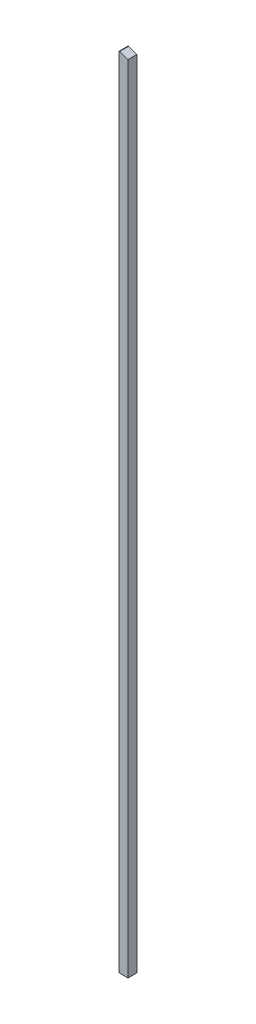
ISO-10303-21;
HEADER;
FILE_DESCRIPTION(('STEP AP214'),'2;1');
FILE_NAME('part.step','',(''),(''),'','','');
FILE_SCHEMA(('AUTOMOTIVE_DESIGN { 1 0 10303 214 1 1 1 1 }'));
ENDSEC;
DATA;
#1=APPLICATION_CONTEXT('core data for automotive mechanical design processes');
#2=APPLICATION_PROTOCOL_DEFINITION('international standard','automotive_design',2000,#1);
#3=PRODUCT_CONTEXT('',#1,'mechanical');
#4=PRODUCT('Part','Part','',(#3));
#5=PRODUCT_RELATED_PRODUCT_CATEGORY('part','',(#4));
#6=PRODUCT_DEFINITION_FORMATION('','',#4);
#7=PRODUCT_DEFINITION_CONTEXT('part definition',#1,'design');
#8=PRODUCT_DEFINITION('design','',#6,#7);
#9=PRODUCT_DEFINITION_SHAPE('','',#8);
#10=(LENGTH_UNIT() NAMED_UNIT(*) SI_UNIT(.MILLI.,.METRE.));
#11=(NAMED_UNIT(*) PLANE_ANGLE_UNIT() SI_UNIT($,.RADIAN.));
#12=(NAMED_UNIT(*) SI_UNIT($,.STERADIAN.) SOLID_ANGLE_UNIT());
#13=UNCERTAINTY_MEASURE_WITH_UNIT(LENGTH_MEASURE(1.E-05),#10,'distance_accuracy_value','');
#14=(GEOMETRIC_REPRESENTATION_CONTEXT(3) GLOBAL_UNCERTAINTY_ASSIGNED_CONTEXT((#13)) GLOBAL_UNIT_ASSIGNED_CONTEXT((#10,
#11,#12)) REPRESENTATION_CONTEXT('',''));
#15=CARTESIAN_POINT('',(0.,0.,0.));
#16=DIRECTION('',(0.,0.,1.));
#17=DIRECTION('',(1.,0.,0.));
#18=AXIS2_PLACEMENT_3D('',#15,#16,#17);
#19=CARTESIAN_POINT('',(-4.44089209850063E-13,2286.00000000001,0.));
#20=DIRECTION('',(1.,0.,0.));
#21=DIRECTION('',(0.,0.,-0.999999999999998));
#22=AXIS2_PLACEMENT_3D('',#19,#20,#21);
#23=PLANE('',#22);
#24=DIRECTION('',(0.,0.,0.999999999999998));
#25=VECTOR('',#24,1.);
#26=CARTESIAN_POINT('',(0.,0.,0.));
#27=LINE('',#26,#25);
#28=CARTESIAN_POINT('',(0.,0.,-25.4000000000001));
#29=VERTEX_POINT('',#28);
#30=CARTESIAN_POINT('',(0.,0.,0.));
#31=VERTEX_POINT('',#30);
#32=EDGE_CURVE('E107',#29,#31,#27,.T.);
#33=ORIENTED_EDGE('',*,*,#32,.T.);
#34=DIRECTION('',(0.,-1.,0.));
#35=VECTOR('',#34,1.);
#36=CARTESIAN_POINT('',(-4.44089209850063E-13,2286.00000000001,0.));
#37=LINE('',#36,#35);
#38=CARTESIAN_POINT('',(-4.44089209850063E-13,2286.00000000001,0.));
#39=VERTEX_POINT('',#38);
#40=EDGE_CURVE('E90',#39,#31,#37,.T.);
#41=ORIENTED_EDGE('',*,*,#40,.F.);
#42=DIRECTION('',(0.,0.,0.999999999999998));
#43=VECTOR('',#42,1.);
#44=CARTESIAN_POINT('',(-4.44089209850063E-13,2286.00000000001,0.));
#45=LINE('',#44,#43);
#46=CARTESIAN_POINT('',(-4.44089209850063E-13,2286.00000000001,-25.4000000000001));
#47=VERTEX_POINT('',#46);
#48=EDGE_CURVE('E97',#47,#39,#45,.T.);
#49=ORIENTED_EDGE('',*,*,#48,.F.);
#50=DIRECTION('',(0.,-1.,0.));
#51=VECTOR('',#50,1.);
#52=CARTESIAN_POINT('',(-4.44089209850063E-13,2286.00000000001,-25.4000000000001));
#53=LINE('',#52,#51);
#54=EDGE_CURVE('E117',#47,#29,#53,.T.);
#55=ORIENTED_EDGE('',*,*,#54,.T.);
#56=EDGE_LOOP('',(#33,#41,#49,#55));
#57=FACE_BOUND('',#56,.T.);
#58=ADVANCED_FACE('F40',(#57),#23,.F.);
#59=CARTESIAN_POINT('',(-4.44089209850063E-13,2286.00000000001,0.));
#60=DIRECTION('',(0.,0.,-0.999999999999998));
#61=DIRECTION('',(-1.,0.,0.));
#62=AXIS2_PLACEMENT_3D('',#59,#60,#61);
#63=PLANE('',#62);
#64=DIRECTION('',(0.,-1.,0.));
#65=VECTOR('',#64,1.);
#66=CARTESIAN_POINT('',(25.4000000000012,2286.,0.));
#67=LINE('',#66,#65);
#68=CARTESIAN_POINT('',(25.400000000001,2277.61800000001,0.));
#69=VERTEX_POINT('',#68);
#70=CARTESIAN_POINT('',(25.4000000000014,2.88657986402541E-12,0.));
#71=VERTEX_POINT('',#70);
#72=EDGE_CURVE('E109',#69,#71,#67,.T.);
#73=ORIENTED_EDGE('',*,*,#72,.F.);
#74=DIRECTION('',(0.943544952869572,-0.331244504730811,0.));
#75=VECTOR('',#74,1.);
#76=CARTESIAN_POINT('',(1.52400000000164,2286.00000000001,0.));
#77=LINE('',#76,#75);
#78=CARTESIAN_POINT('',(1.52400000000164,2286.00000000001,0.));
#79=VERTEX_POINT('',#78);
#80=EDGE_CURVE('E11',#69,#79,#77,.F.);
#81=ORIENTED_EDGE('',*,*,#80,.T.);
#82=DIRECTION('',(1.,0.,0.));
#83=VECTOR('',#82,1.);
#84=CARTESIAN_POINT('',(-4.44089209850063E-13,2286.00000000001,0.));
#85=LINE('',#84,#83);
#86=EDGE_CURVE('E85',#39,#79,#85,.T.);
#87=ORIENTED_EDGE('',*,*,#86,.F.);
#88=ORIENTED_EDGE('',*,*,#40,.T.);
#89=DIRECTION('',(1.,0.,0.));
#90=VECTOR('',#89,1.);
#91=CARTESIAN_POINT('',(0.,0.,0.));
#92=LINE('',#91,#90);
#93=EDGE_CURVE('E123',#31,#71,#92,.T.);
#94=ORIENTED_EDGE('',*,*,#93,.T.);
#95=EDGE_LOOP('',(#73,#81,#87,#88,#94));
#96=FACE_BOUND('',#95,.T.);
#97=ADVANCED_FACE('F87',(#96),#63,.F.);
#98=CARTESIAN_POINT('',(25.4000000000012,2286.,0.));
#99=DIRECTION('',(-1.,0.,0.));
#100=DIRECTION('',(0.,0.,0.999999999999998));
#101=AXIS2_PLACEMENT_3D('',#98,#99,#100);
#102=PLANE('',#101);
#103=DIRECTION('',(0.,-1.,0.));
#104=VECTOR('',#103,1.);
#105=CARTESIAN_POINT('',(25.4000000000012,2286.,-25.4000000000001));
#106=LINE('',#105,#104);
#107=CARTESIAN_POINT('',(25.400000000001,2277.61800000001,-25.4000000000001));
#108=VERTEX_POINT('',#107);
#109=CARTESIAN_POINT('',(25.4000000000014,2.88657986402541E-12,-25.4000000000001));
#110=VERTEX_POINT('',#109);
#111=EDGE_CURVE('E112',#108,#110,#106,.T.);
#112=ORIENTED_EDGE('',*,*,#111,.F.);
#113=DIRECTION('',(0.,0.,0.999999999999998));
#114=VECTOR('',#113,1.);
#115=CARTESIAN_POINT('',(25.400000000001,2277.61800000001,0.));
#116=LINE('',#115,#114);
#117=EDGE_CURVE('E48',#108,#69,#116,.T.);
#118=ORIENTED_EDGE('',*,*,#117,.T.);
#119=ORIENTED_EDGE('',*,*,#72,.T.);
#120=DIRECTION('',(0.,0.,-0.999999999999998));
#121=VECTOR('',#120,1.);
#122=CARTESIAN_POINT('',(25.4000000000014,2.88657986402541E-12,0.));
#123=LINE('',#122,#121);
#124=EDGE_CURVE('E120',#71,#110,#123,.T.);
#125=ORIENTED_EDGE('',*,*,#124,.T.);
#126=EDGE_LOOP('',(#112,#118,#119,#125));
#127=FACE_BOUND('',#126,.T.);
#128=ADVANCED_FACE('F130',(#127),#102,.F.);
#129=CARTESIAN_POINT('',(-4.44089209850063E-13,2286.00000000001,-25.4000000000001));
#130=DIRECTION('',(0.,0.,0.999999999999998));
#131=DIRECTION('',(1.,0.,0.));
#132=AXIS2_PLACEMENT_3D('',#129,#130,#131);
#133=PLANE('',#132);
#134=DIRECTION('',(-1.,0.,0.));
#135=VECTOR('',#134,1.);
#136=CARTESIAN_POINT('',(-4.44089209850063E-13,2286.00000000001,-25.4000000000001));
#137=LINE('',#136,#135);
#138=CARTESIAN_POINT('',(1.52400000000164,2286.00000000001,-25.4000000000001));
#139=VERTEX_POINT('',#138);
#140=EDGE_CURVE('E96',#139,#47,#137,.T.);
#141=ORIENTED_EDGE('',*,*,#140,.F.);
#142=DIRECTION('',(-0.943544952869572,0.331244504730811,0.));
#143=VECTOR('',#142,1.);
#144=CARTESIAN_POINT('',(1.52400000000164,2286.00000000001,-25.4000000000001));
#145=LINE('',#144,#143);
#146=EDGE_CURVE('E62',#139,#108,#145,.F.);
#147=ORIENTED_EDGE('',*,*,#146,.T.);
#148=ORIENTED_EDGE('',*,*,#111,.T.);
#149=DIRECTION('',(-1.,0.,0.));
#150=VECTOR('',#149,1.);
#151=CARTESIAN_POINT('',(0.,0.,-25.4000000000001));
#152=LINE('',#151,#150);
#153=EDGE_CURVE('E104',#110,#29,#152,.T.);
#154=ORIENTED_EDGE('',*,*,#153,.T.);
#155=ORIENTED_EDGE('',*,*,#54,.F.);
#156=EDGE_LOOP('',(#141,#147,#148,#154,#155));
#157=FACE_BOUND('',#156,.T.);
#158=ADVANCED_FACE('F132',(#157),#133,.F.);
#159=CARTESIAN_POINT('',(-4.44089209850063E-13,2286.00000000001,0.));
#160=DIRECTION('',(0.,-1.,0.));
#161=DIRECTION('',(0.,0.,-0.999999999999998));
#162=AXIS2_PLACEMENT_3D('',#159,#160,#161);
#163=PLANE('',#162);
#164=ORIENTED_EDGE('',*,*,#86,.T.);
#165=DIRECTION('',(0.,0.,-0.999999999999998));
#166=VECTOR('',#165,1.);
#167=CARTESIAN_POINT('',(1.52400000000164,2286.00000000001,0.));
#168=LINE('',#167,#166);
#169=EDGE_CURVE('E108',#79,#139,#168,.T.);
#170=ORIENTED_EDGE('',*,*,#169,.T.);
#171=ORIENTED_EDGE('',*,*,#140,.T.);
#172=ORIENTED_EDGE('',*,*,#48,.T.);
#173=EDGE_LOOP('',(#164,#170,#171,#172));
#174=FACE_BOUND('',#173,.T.);
#175=ADVANCED_FACE('F100',(#174),#163,.F.);
#176=CARTESIAN_POINT('',(0.,0.,0.));
#177=DIRECTION('',(0.,-1.,0.));
#178=DIRECTION('',(0.,0.,-0.999999999999998));
#179=AXIS2_PLACEMENT_3D('',#176,#177,#178);
#180=PLANE('',#179);
#181=ORIENTED_EDGE('',*,*,#32,.F.);
#182=ORIENTED_EDGE('',*,*,#153,.F.);
#183=ORIENTED_EDGE('',*,*,#124,.F.);
#184=ORIENTED_EDGE('',*,*,#93,.F.);
#185=EDGE_LOOP('',(#181,#182,#183,#184));
#186=FACE_BOUND('',#185,.T.);
#187=ADVANCED_FACE('F129',(#186),#180,.T.);
#188=CARTESIAN_POINT('',(1.52400000000164,2286.00000000001,0.));
#189=DIRECTION('',(-0.331244504730812,-0.943544952869572,0.));
#190=DIRECTION('',(0.,0.,-0.999999999999998));
#191=AXIS2_PLACEMENT_3D('',#188,#189,#190);
#192=PLANE('',#191);
#193=ORIENTED_EDGE('',*,*,#80,.F.);
#194=ORIENTED_EDGE('',*,*,#117,.F.);
#195=ORIENTED_EDGE('',*,*,#146,.F.);
#196=ORIENTED_EDGE('',*,*,#169,.F.);
#197=EDGE_LOOP('',(#193,#194,#195,#196));
#198=FACE_BOUND('',#197,.T.);
#199=ADVANCED_FACE('F42',(#198),#192,.F.);
#200=CLOSED_SHELL('',(#58,#97,#128,#158,#175,#187,#199));
#201=MANIFOLD_SOLID_BREP('B2',#200);
#202=ADVANCED_BREP_SHAPE_REPRESENTATION('',(#18,#201),#14);
#203=SHAPE_DEFINITION_REPRESENTATION(#9,#202);
ENDSEC;
END-ISO-10303-21;
